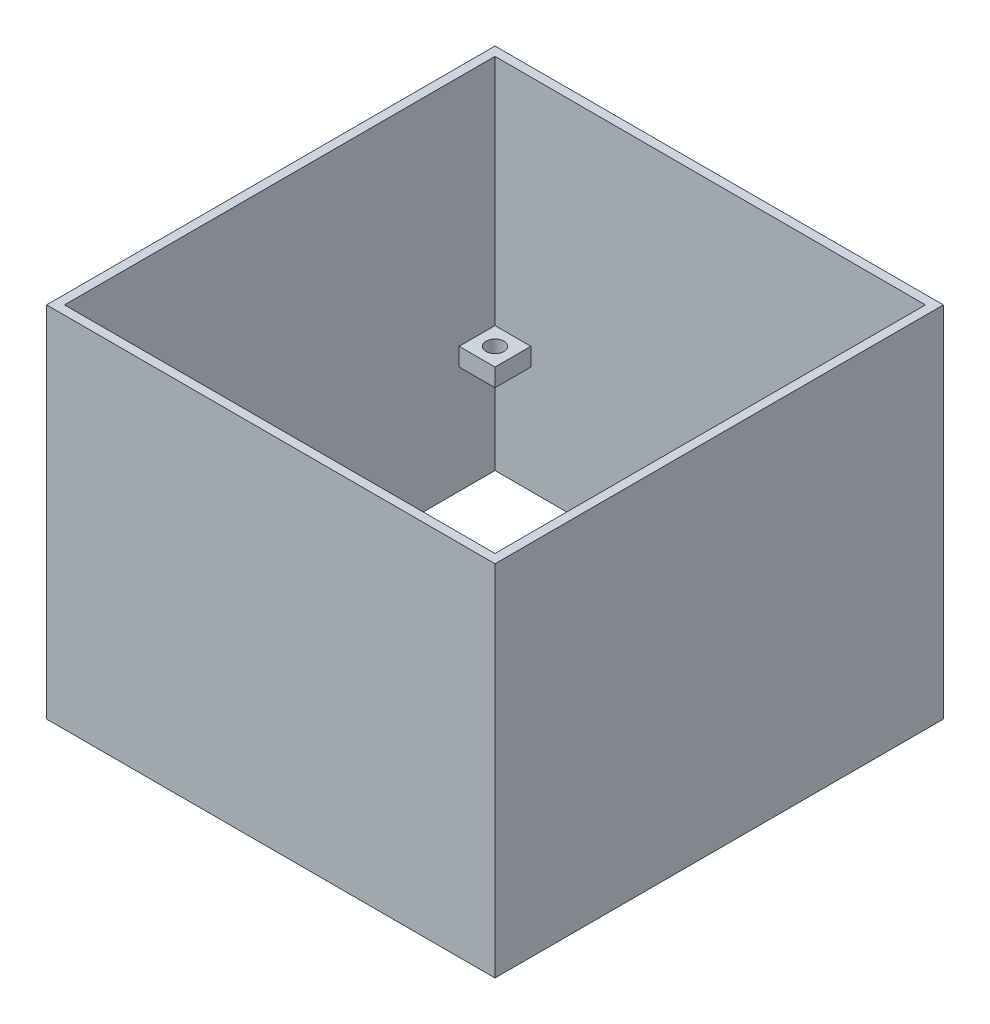
ISO-10303-21;
HEADER;
FILE_DESCRIPTION(('STEP AP214'),'2;1');
FILE_NAME('part.step','',(''),(''),'','','');
FILE_SCHEMA(('AUTOMOTIVE_DESIGN { 1 0 10303 214 1 1 1 1 }'));
ENDSEC;
DATA;
#1=APPLICATION_CONTEXT('core data for automotive mechanical design processes');
#2=APPLICATION_PROTOCOL_DEFINITION('international standard','automotive_design',2000,#1);
#3=PRODUCT_CONTEXT('',#1,'mechanical');
#4=PRODUCT('Part','Part','',(#3));
#5=PRODUCT_RELATED_PRODUCT_CATEGORY('part','',(#4));
#6=PRODUCT_DEFINITION_FORMATION('','',#4);
#7=PRODUCT_DEFINITION_CONTEXT('part definition',#1,'design');
#8=PRODUCT_DEFINITION('design','',#6,#7);
#9=PRODUCT_DEFINITION_SHAPE('','',#8);
#10=(LENGTH_UNIT() NAMED_UNIT(*) SI_UNIT(.MILLI.,.METRE.));
#11=(NAMED_UNIT(*) PLANE_ANGLE_UNIT() SI_UNIT($,.RADIAN.));
#12=(NAMED_UNIT(*) SI_UNIT($,.STERADIAN.) SOLID_ANGLE_UNIT());
#13=UNCERTAINTY_MEASURE_WITH_UNIT(LENGTH_MEASURE(1.E-05),#10,'distance_accuracy_value','');
#14=(GEOMETRIC_REPRESENTATION_CONTEXT(3) GLOBAL_UNCERTAINTY_ASSIGNED_CONTEXT((#13)) GLOBAL_UNIT_ASSIGNED_CONTEXT((#10,
#11,#12)) REPRESENTATION_CONTEXT('',''));
#15=CARTESIAN_POINT('',(0.,0.,0.));
#16=DIRECTION('',(0.,0.,1.));
#17=DIRECTION('',(1.,0.,0.));
#18=AXIS2_PLACEMENT_3D('',#15,#16,#17);
#19=CARTESIAN_POINT('',(0.,100.,0.));
#20=DIRECTION('',(0.,-1.,0.));
#21=DIRECTION('',(0.,0.,-1.));
#22=AXIS2_PLACEMENT_3D('',#19,#20,#21);
#23=PLANE('',#22);
#24=DIRECTION('',(0.,0.,-1.));
#25=VECTOR('',#24,1.);
#26=CARTESIAN_POINT('',(60.,100.,60.));
#27=LINE('',#26,#25);
#28=CARTESIAN_POINT('',(60.0000000000014,100.,60.0000000000014));
#29=VERTEX_POINT('',#28);
#30=CARTESIAN_POINT('',(60.0000000000014,100.,-60.0000000000014));
#31=VERTEX_POINT('',#30);
#32=EDGE_CURVE('E217',#29,#31,#27,.T.);
#33=ORIENTED_EDGE('',*,*,#32,.F.);
#34=DIRECTION('',(1.,0.,0.));
#35=VECTOR('',#34,1.);
#36=CARTESIAN_POINT('',(-60.,100.,60.));
#37=LINE('',#36,#35);
#38=CARTESIAN_POINT('',(-60.0000000000014,100.,60.0000000000014));
#39=VERTEX_POINT('',#38);
#40=EDGE_CURVE('E357',#39,#29,#37,.T.);
#41=ORIENTED_EDGE('',*,*,#40,.F.);
#42=DIRECTION('',(0.,0.,1.));
#43=VECTOR('',#42,1.);
#44=CARTESIAN_POINT('',(-60.,100.,60.));
#45=LINE('',#44,#43);
#46=CARTESIAN_POINT('',(-60.0000000000014,100.,-60.0000000000014));
#47=VERTEX_POINT('',#46);
#48=EDGE_CURVE('E355',#47,#39,#45,.T.);
#49=ORIENTED_EDGE('',*,*,#48,.F.);
#50=DIRECTION('',(-1.,0.,0.));
#51=VECTOR('',#50,1.);
#52=CARTESIAN_POINT('',(-60.,100.,-60.));
#53=LINE('',#52,#51);
#54=EDGE_CURVE('E352',#31,#47,#53,.T.);
#55=ORIENTED_EDGE('',*,*,#54,.F.);
#56=EDGE_LOOP('',(#33,#41,#49,#55));
#57=FACE_BOUND('',#56,.T.);
#58=DIRECTION('',(0.,0.,-1.));
#59=VECTOR('',#58,1.);
#60=CARTESIAN_POINT('',(62.5,100.,62.5));
#61=LINE('',#60,#59);
#62=CARTESIAN_POINT('',(62.5,100.,62.5));
#63=VERTEX_POINT('',#62);
#64=CARTESIAN_POINT('',(62.5,100.,-62.5));
#65=VERTEX_POINT('',#64);
#66=EDGE_CURVE('E378',#63,#65,#61,.T.);
#67=ORIENTED_EDGE('',*,*,#66,.T.);
#68=DIRECTION('',(-1.,0.,0.));
#69=VECTOR('',#68,1.);
#70=CARTESIAN_POINT('',(-62.5,100.,-62.5));
#71=LINE('',#70,#69);
#72=CARTESIAN_POINT('',(-62.5,100.,-62.5));
#73=VERTEX_POINT('',#72);
#74=EDGE_CURVE('E381',#65,#73,#71,.T.);
#75=ORIENTED_EDGE('',*,*,#74,.T.);
#76=DIRECTION('',(0.,0.,1.));
#77=VECTOR('',#76,1.);
#78=CARTESIAN_POINT('',(-62.5,100.,62.5));
#79=LINE('',#78,#77);
#80=CARTESIAN_POINT('',(-62.5,100.,62.5));
#81=VERTEX_POINT('',#80);
#82=EDGE_CURVE('E384',#73,#81,#79,.T.);
#83=ORIENTED_EDGE('',*,*,#82,.T.);
#84=DIRECTION('',(1.,0.,0.));
#85=VECTOR('',#84,1.);
#86=CARTESIAN_POINT('',(-62.5,100.,62.5));
#87=LINE('',#86,#85);
#88=EDGE_CURVE('E386',#81,#63,#87,.T.);
#89=ORIENTED_EDGE('',*,*,#88,.T.);
#90=EDGE_LOOP('',(#67,#75,#83,#89));
#91=FACE_BOUND('',#90,.T.);
#92=ADVANCED_FACE('F41',(#57,#91),#23,.F.);
#93=CARTESIAN_POINT('',(0.,0.,0.));
#94=DIRECTION('',(0.,-1.,0.));
#95=DIRECTION('',(0.,0.,-1.));
#96=AXIS2_PLACEMENT_3D('',#93,#94,#95);
#97=PLANE('',#96);
#98=DIRECTION('',(0.,0.,-1.));
#99=VECTOR('',#98,1.);
#100=CARTESIAN_POINT('',(62.5,0.,62.5));
#101=LINE('',#100,#99);
#102=CARTESIAN_POINT('',(62.5,0.,62.5));
#103=VERTEX_POINT('',#102);
#104=CARTESIAN_POINT('',(62.5,0.,-62.5));
#105=VERTEX_POINT('',#104);
#106=EDGE_CURVE('E377',#103,#105,#101,.T.);
#107=ORIENTED_EDGE('',*,*,#106,.F.);
#108=DIRECTION('',(1.,0.,0.));
#109=VECTOR('',#108,1.);
#110=CARTESIAN_POINT('',(-62.5,0.,62.5));
#111=LINE('',#110,#109);
#112=CARTESIAN_POINT('',(-62.5,0.,62.5));
#113=VERTEX_POINT('',#112);
#114=EDGE_CURVE('E382',#113,#103,#111,.T.);
#115=ORIENTED_EDGE('',*,*,#114,.F.);
#116=DIRECTION('',(0.,0.,1.));
#117=VECTOR('',#116,1.);
#118=CARTESIAN_POINT('',(-62.5,0.,62.5));
#119=LINE('',#118,#117);
#120=CARTESIAN_POINT('',(-62.5,0.,-62.5));
#121=VERTEX_POINT('',#120);
#122=EDGE_CURVE('E393',#121,#113,#119,.T.);
#123=ORIENTED_EDGE('',*,*,#122,.F.);
#124=DIRECTION('',(-1.,0.,0.));
#125=VECTOR('',#124,1.);
#126=CARTESIAN_POINT('',(-62.5,0.,-62.5));
#127=LINE('',#126,#125);
#128=EDGE_CURVE('E391',#105,#121,#127,.T.);
#129=ORIENTED_EDGE('',*,*,#128,.F.);
#130=EDGE_LOOP('',(#107,#115,#123,#129));
#131=FACE_BOUND('',#130,.T.);
#132=DIRECTION('',(1.,0.,0.));
#133=VECTOR('',#132,1.);
#134=CARTESIAN_POINT('',(-60.,0.,60.));
#135=LINE('',#134,#133);
#136=CARTESIAN_POINT('',(-60.,0.,60.));
#137=VERTEX_POINT('',#136);
#138=CARTESIAN_POINT('',(60.,0.,60.));
#139=VERTEX_POINT('',#138);
#140=EDGE_CURVE('E353',#137,#139,#135,.T.);
#141=ORIENTED_EDGE('',*,*,#140,.T.);
#142=DIRECTION('',(0.,0.,-1.));
#143=VECTOR('',#142,1.);
#144=CARTESIAN_POINT('',(60.,0.,60.));
#145=LINE('',#144,#143);
#146=CARTESIAN_POINT('',(60.,0.,-60.));
#147=VERTEX_POINT('',#146);
#148=EDGE_CURVE('E345',#139,#147,#145,.T.);
#149=ORIENTED_EDGE('',*,*,#148,.T.);
#150=DIRECTION('',(-1.,0.,0.));
#151=VECTOR('',#150,1.);
#152=CARTESIAN_POINT('',(-60.,0.,-60.));
#153=LINE('',#152,#151);
#154=CARTESIAN_POINT('',(-60.,0.,-60.));
#155=VERTEX_POINT('',#154);
#156=EDGE_CURVE('E362',#147,#155,#153,.T.);
#157=ORIENTED_EDGE('',*,*,#156,.T.);
#158=DIRECTION('',(0.,0.,1.));
#159=VECTOR('',#158,1.);
#160=CARTESIAN_POINT('',(-60.,0.,60.));
#161=LINE('',#160,#159);
#162=EDGE_CURVE('E365',#155,#137,#161,.T.);
#163=ORIENTED_EDGE('',*,*,#162,.T.);
#164=EDGE_LOOP('',(#141,#149,#157,#163));
#165=FACE_BOUND('',#164,.T.);
#166=ADVANCED_FACE('F414',(#131,#165),#97,.T.);
#167=CARTESIAN_POINT('',(62.5,100.,62.5));
#168=DIRECTION('',(-1.,0.,0.));
#169=DIRECTION('',(0.,0.,1.));
#170=AXIS2_PLACEMENT_3D('',#167,#168,#169);
#171=PLANE('',#170);
#172=ORIENTED_EDGE('',*,*,#106,.T.);
#173=DIRECTION('',(0.,-1.,0.));
#174=VECTOR('',#173,1.);
#175=CARTESIAN_POINT('',(62.5,100.,-62.5));
#176=LINE('',#175,#174);
#177=EDGE_CURVE('E49',#65,#105,#176,.T.);
#178=ORIENTED_EDGE('',*,*,#177,.F.);
#179=ORIENTED_EDGE('',*,*,#66,.F.);
#180=DIRECTION('',(0.,-1.,0.));
#181=VECTOR('',#180,1.);
#182=CARTESIAN_POINT('',(62.5,100.,62.5));
#183=LINE('',#182,#181);
#184=EDGE_CURVE('E388',#63,#103,#183,.T.);
#185=ORIENTED_EDGE('',*,*,#184,.T.);
#186=EDGE_LOOP('',(#172,#178,#179,#185));
#187=FACE_BOUND('',#186,.T.);
#188=ADVANCED_FACE('F43',(#187),#171,.F.);
#189=CARTESIAN_POINT('',(-62.5,100.,-62.5));
#190=DIRECTION('',(0.,0.,1.));
#191=DIRECTION('',(1.,0.,0.));
#192=AXIS2_PLACEMENT_3D('',#189,#190,#191);
#193=PLANE('',#192);
#194=ORIENTED_EDGE('',*,*,#128,.T.);
#195=DIRECTION('',(0.,-1.,0.));
#196=VECTOR('',#195,1.);
#197=CARTESIAN_POINT('',(-62.5,100.,-62.5));
#198=LINE('',#197,#196);
#199=EDGE_CURVE('E401',#73,#121,#198,.T.);
#200=ORIENTED_EDGE('',*,*,#199,.F.);
#201=ORIENTED_EDGE('',*,*,#74,.F.);
#202=ORIENTED_EDGE('',*,*,#177,.T.);
#203=EDGE_LOOP('',(#194,#200,#201,#202));
#204=FACE_BOUND('',#203,.T.);
#205=ADVANCED_FACE('F406',(#204),#193,.F.);
#206=CARTESIAN_POINT('',(-62.5,100.,62.5));
#207=DIRECTION('',(1.,0.,0.));
#208=DIRECTION('',(0.,0.,-1.));
#209=AXIS2_PLACEMENT_3D('',#206,#207,#208);
#210=PLANE('',#209);
#211=ORIENTED_EDGE('',*,*,#122,.T.);
#212=DIRECTION('',(0.,-1.,0.));
#213=VECTOR('',#212,1.);
#214=CARTESIAN_POINT('',(-62.5,100.,62.5));
#215=LINE('',#214,#213);
#216=EDGE_CURVE('E398',#81,#113,#215,.T.);
#217=ORIENTED_EDGE('',*,*,#216,.F.);
#218=ORIENTED_EDGE('',*,*,#82,.F.);
#219=ORIENTED_EDGE('',*,*,#199,.T.);
#220=EDGE_LOOP('',(#211,#217,#218,#219));
#221=FACE_BOUND('',#220,.T.);
#222=ADVANCED_FACE('F419',(#221),#210,.F.);
#223=CARTESIAN_POINT('',(-62.5,100.,62.5));
#224=DIRECTION('',(0.,0.,-1.));
#225=DIRECTION('',(-1.,0.,0.));
#226=AXIS2_PLACEMENT_3D('',#223,#224,#225);
#227=PLANE('',#226);
#228=ORIENTED_EDGE('',*,*,#114,.T.);
#229=ORIENTED_EDGE('',*,*,#184,.F.);
#230=ORIENTED_EDGE('',*,*,#88,.F.);
#231=ORIENTED_EDGE('',*,*,#216,.T.);
#232=EDGE_LOOP('',(#228,#229,#230,#231));
#233=FACE_BOUND('',#232,.T.);
#234=ADVANCED_FACE('F423',(#233),#227,.F.);
#235=CARTESIAN_POINT('',(60.,100.,60.));
#236=DIRECTION('',(-1.,0.,0.));
#237=DIRECTION('',(0.,0.,1.));
#238=AXIS2_PLACEMENT_3D('',#235,#236,#237);
#239=PLANE('',#238);
#240=DIRECTION('',(0.,1.,0.));
#241=VECTOR('',#240,1.);
#242=CARTESIAN_POINT('',(60.0000000000014,30.,49.9999999999986));
#243=LINE('',#242,#241);
#244=CARTESIAN_POINT('',(60.,30.,49.9999999999986));
#245=VERTEX_POINT('',#244);
#246=CARTESIAN_POINT('',(60.0000000000014,35.0000000000001,49.9999999999986));
#247=VERTEX_POINT('',#246);
#248=EDGE_CURVE('E297',#245,#247,#243,.T.);
#249=ORIENTED_EDGE('',*,*,#248,.T.);
#250=DIRECTION('',(0.,0.,-1.));
#251=VECTOR('',#250,1.);
#252=CARTESIAN_POINT('',(60.0000000000014,35.0000000000001,60.0000000000014));
#253=LINE('',#252,#251);
#254=CARTESIAN_POINT('',(60.0000000000014,35.0000000000001,60.0000000000014));
#255=VERTEX_POINT('',#254);
#256=EDGE_CURVE('E56',#255,#247,#253,.T.);
#257=ORIENTED_EDGE('',*,*,#256,.F.);
#258=DIRECTION('',(0.,1.,0.));
#259=VECTOR('',#258,1.);
#260=CARTESIAN_POINT('',(60.0000000000014,35.0000000000001,60.0000000000014));
#261=LINE('',#260,#259);
#262=EDGE_CURVE('E234',#255,#29,#261,.T.);
#263=ORIENTED_EDGE('',*,*,#262,.T.);
#264=ORIENTED_EDGE('',*,*,#32,.T.);
#265=DIRECTION('',(0.,1.,0.));
#266=VECTOR('',#265,1.);
#267=CARTESIAN_POINT('',(60.0000000000014,35.0000000000001,-60.0000000000014));
#268=LINE('',#267,#266);
#269=CARTESIAN_POINT('',(60.0000000000014,35.0000000000001,-60.0000000000014));
#270=VERTEX_POINT('',#269);
#271=EDGE_CURVE('E212',#270,#31,#268,.T.);
#272=ORIENTED_EDGE('',*,*,#271,.F.);
#273=CARTESIAN_POINT('',(60.0000000000014,35.0000000000001,-50.0000000000014));
#274=VERTEX_POINT('',#273);
#275=EDGE_CURVE('E200',#274,#270,#253,.T.);
#276=ORIENTED_EDGE('',*,*,#275,.F.);
#277=DIRECTION('',(0.,1.,0.));
#278=VECTOR('',#277,1.);
#279=CARTESIAN_POINT('',(60.,30.,-50.0000000000014));
#280=LINE('',#279,#278);
#281=CARTESIAN_POINT('',(60.,30.,-50.0000000000014));
#282=VERTEX_POINT('',#281);
#283=EDGE_CURVE('E284',#282,#274,#280,.T.);
#284=ORIENTED_EDGE('',*,*,#283,.F.);
#285=DIRECTION('',(0.,0.,-1.));
#286=VECTOR('',#285,1.);
#287=CARTESIAN_POINT('',(60.,30.,-60.0000000000014));
#288=LINE('',#287,#286);
#289=CARTESIAN_POINT('',(60.,30.,-60.));
#290=VERTEX_POINT('',#289);
#291=EDGE_CURVE('E294',#282,#290,#288,.T.);
#292=ORIENTED_EDGE('',*,*,#291,.T.);
#293=DIRECTION('',(0.,-1.,0.));
#294=VECTOR('',#293,1.);
#295=CARTESIAN_POINT('',(60.,100.,-60.));
#296=LINE('',#295,#294);
#297=EDGE_CURVE('E375',#290,#147,#296,.T.);
#298=ORIENTED_EDGE('',*,*,#297,.T.);
#299=ORIENTED_EDGE('',*,*,#148,.F.);
#300=DIRECTION('',(0.,-1.,0.));
#301=VECTOR('',#300,1.);
#302=CARTESIAN_POINT('',(60.,100.,60.));
#303=LINE('',#302,#301);
#304=CARTESIAN_POINT('',(60.,30.,60.));
#305=VERTEX_POINT('',#304);
#306=EDGE_CURVE('E359',#305,#139,#303,.T.);
#307=ORIENTED_EDGE('',*,*,#306,.F.);
#308=DIRECTION('',(0.,0.,-1.));
#309=VECTOR('',#308,1.);
#310=CARTESIAN_POINT('',(60.0000000000014,30.,59.9999999999986));
#311=LINE('',#310,#309);
#312=EDGE_CURVE('E312',#305,#245,#311,.T.);
#313=ORIENTED_EDGE('',*,*,#312,.T.);
#314=EDGE_LOOP('',(#249,#257,#263,#264,#272,#276,#284,#292,#298,#299,#307,#313));
#315=FACE_BOUND('',#314,.T.);
#316=ADVANCED_FACE('F214',(#315),#239,.T.);
#317=CARTESIAN_POINT('',(-60.,100.,-60.));
#318=DIRECTION('',(0.,0.,1.));
#319=DIRECTION('',(1.,0.,0.));
#320=AXIS2_PLACEMENT_3D('',#317,#318,#319);
#321=PLANE('',#320);
#322=DIRECTION('',(0.,1.,0.));
#323=VECTOR('',#322,1.);
#324=CARTESIAN_POINT('',(50.,30.,-60.0000000000014));
#325=LINE('',#324,#323);
#326=CARTESIAN_POINT('',(50.,30.,-60.));
#327=VERTEX_POINT('',#326);
#328=CARTESIAN_POINT('',(50.,35.0000000000001,-60.0000000000014));
#329=VERTEX_POINT('',#328);
#330=EDGE_CURVE('E225',#327,#329,#325,.T.);
#331=ORIENTED_EDGE('',*,*,#330,.T.);
#332=DIRECTION('',(-1.,0.,0.));
#333=VECTOR('',#332,1.);
#334=CARTESIAN_POINT('',(-60.0000000000014,35.0000000000001,-60.0000000000014));
#335=LINE('',#334,#333);
#336=EDGE_CURVE('E204',#270,#329,#335,.T.);
#337=ORIENTED_EDGE('',*,*,#336,.F.);
#338=ORIENTED_EDGE('',*,*,#271,.T.);
#339=ORIENTED_EDGE('',*,*,#54,.T.);
#340=DIRECTION('',(0.,1.,0.));
#341=VECTOR('',#340,1.);
#342=CARTESIAN_POINT('',(-60.0000000000014,35.0000000000001,-60.0000000000014));
#343=LINE('',#342,#341);
#344=CARTESIAN_POINT('',(-60.0000000000014,35.0000000000001,-60.0000000000014));
#345=VERTEX_POINT('',#344);
#346=EDGE_CURVE('E220',#345,#47,#343,.T.);
#347=ORIENTED_EDGE('',*,*,#346,.F.);
#348=CARTESIAN_POINT('',(-50.,35.0000000000001,-60.0000000000014));
#349=VERTEX_POINT('',#348);
#350=EDGE_CURVE('E227',#349,#345,#335,.T.);
#351=ORIENTED_EDGE('',*,*,#350,.F.);
#352=DIRECTION('',(0.,1.,0.));
#353=VECTOR('',#352,1.);
#354=CARTESIAN_POINT('',(-50.,30.,-60.));
#355=LINE('',#354,#353);
#356=CARTESIAN_POINT('',(-50.,30.,-60.));
#357=VERTEX_POINT('',#356);
#358=EDGE_CURVE('E342',#357,#349,#355,.T.);
#359=ORIENTED_EDGE('',*,*,#358,.F.);
#360=DIRECTION('',(-1.,0.,0.));
#361=VECTOR('',#360,1.);
#362=CARTESIAN_POINT('',(-60.,30.,-60.));
#363=LINE('',#362,#361);
#364=CARTESIAN_POINT('',(-60.,30.,-60.));
#365=VERTEX_POINT('',#364);
#366=EDGE_CURVE('E339',#357,#365,#363,.T.);
#367=ORIENTED_EDGE('',*,*,#366,.T.);
#368=DIRECTION('',(0.,-1.,0.));
#369=VECTOR('',#368,1.);
#370=CARTESIAN_POINT('',(-60.,100.,-60.));
#371=LINE('',#370,#369);
#372=EDGE_CURVE('E373',#365,#155,#371,.T.);
#373=ORIENTED_EDGE('',*,*,#372,.T.);
#374=ORIENTED_EDGE('',*,*,#156,.F.);
#375=ORIENTED_EDGE('',*,*,#297,.F.);
#376=DIRECTION('',(-1.,0.,0.));
#377=VECTOR('',#376,1.);
#378=CARTESIAN_POINT('',(60.,30.,-60.0000000000014));
#379=LINE('',#378,#377);
#380=EDGE_CURVE('E292',#290,#327,#379,.T.);
#381=ORIENTED_EDGE('',*,*,#380,.T.);
#382=EDGE_LOOP('',(#331,#337,#338,#339,#347,#351,#359,#367,#373,#374,#375,#381));
#383=FACE_BOUND('',#382,.T.);
#384=ADVANCED_FACE('F223',(#383),#321,.T.);
#385=CARTESIAN_POINT('',(-60.,100.,60.));
#386=DIRECTION('',(1.,0.,0.));
#387=DIRECTION('',(0.,0.,-1.));
#388=AXIS2_PLACEMENT_3D('',#385,#386,#387);
#389=PLANE('',#388);
#390=DIRECTION('',(0.,1.,0.));
#391=VECTOR('',#390,1.);
#392=CARTESIAN_POINT('',(-60.,30.,-50.));
#393=LINE('',#392,#391);
#394=CARTESIAN_POINT('',(-60.,30.,-50.));
#395=VERTEX_POINT('',#394);
#396=CARTESIAN_POINT('',(-60.,35.0000000000001,-50.));
#397=VERTEX_POINT('',#396);
#398=EDGE_CURVE('E341',#395,#397,#393,.T.);
#399=ORIENTED_EDGE('',*,*,#398,.T.);
#400=DIRECTION('',(0.,0.,1.));
#401=VECTOR('',#400,1.);
#402=CARTESIAN_POINT('',(-60.0000000000014,35.0000000000001,60.0000000000014));
#403=LINE('',#402,#401);
#404=EDGE_CURVE('E229',#345,#397,#403,.T.);
#405=ORIENTED_EDGE('',*,*,#404,.F.);
#406=ORIENTED_EDGE('',*,*,#346,.T.);
#407=ORIENTED_EDGE('',*,*,#48,.T.);
#408=DIRECTION('',(0.,1.,0.));
#409=VECTOR('',#408,1.);
#410=CARTESIAN_POINT('',(-60.0000000000014,35.0000000000001,60.0000000000014));
#411=LINE('',#410,#409);
#412=CARTESIAN_POINT('',(-60.0000000000014,35.0000000000001,60.0000000000014));
#413=VERTEX_POINT('',#412);
#414=EDGE_CURVE('E236',#413,#39,#411,.T.);
#415=ORIENTED_EDGE('',*,*,#414,.F.);
#416=CARTESIAN_POINT('',(-60.0000000000014,35.0000000000001,50.));
#417=VERTEX_POINT('',#416);
#418=EDGE_CURVE('E226',#417,#413,#403,.T.);
#419=ORIENTED_EDGE('',*,*,#418,.F.);
#420=DIRECTION('',(0.,1.,0.));
#421=VECTOR('',#420,1.);
#422=CARTESIAN_POINT('',(-59.9999999999986,30.,50.));
#423=LINE('',#422,#421);
#424=CARTESIAN_POINT('',(-60.,30.,50.));
#425=VERTEX_POINT('',#424);
#426=EDGE_CURVE('E278',#425,#417,#423,.T.);
#427=ORIENTED_EDGE('',*,*,#426,.F.);
#428=DIRECTION('',(0.,0.,1.));
#429=VECTOR('',#428,1.);
#430=CARTESIAN_POINT('',(-59.9999999999986,30.,60.));
#431=LINE('',#430,#429);
#432=CARTESIAN_POINT('',(-60.,30.,60.));
#433=VERTEX_POINT('',#432);
#434=EDGE_CURVE('E306',#425,#433,#431,.T.);
#435=ORIENTED_EDGE('',*,*,#434,.T.);
#436=DIRECTION('',(0.,-1.,0.));
#437=VECTOR('',#436,1.);
#438=CARTESIAN_POINT('',(-60.,100.,60.));
#439=LINE('',#438,#437);
#440=EDGE_CURVE('E371',#433,#137,#439,.T.);
#441=ORIENTED_EDGE('',*,*,#440,.T.);
#442=ORIENTED_EDGE('',*,*,#162,.F.);
#443=ORIENTED_EDGE('',*,*,#372,.F.);
#444=DIRECTION('',(0.,0.,1.));
#445=VECTOR('',#444,1.);
#446=CARTESIAN_POINT('',(-60.,30.,-60.));
#447=LINE('',#446,#445);
#448=EDGE_CURVE('E296',#365,#395,#447,.T.);
#449=ORIENTED_EDGE('',*,*,#448,.T.);
#450=EDGE_LOOP('',(#399,#405,#406,#407,#415,#419,#427,#435,#441,#442,#443,#449));
#451=FACE_BOUND('',#450,.T.);
#452=ADVANCED_FACE('F476',(#451),#389,.T.);
#453=CARTESIAN_POINT('',(-60.,100.,60.));
#454=DIRECTION('',(0.,0.,-1.));
#455=DIRECTION('',(-1.,0.,0.));
#456=AXIS2_PLACEMENT_3D('',#453,#454,#455);
#457=PLANE('',#456);
#458=DIRECTION('',(0.,1.,0.));
#459=VECTOR('',#458,1.);
#460=CARTESIAN_POINT('',(-49.9999999999986,30.,60.));
#461=LINE('',#460,#459);
#462=CARTESIAN_POINT('',(-49.9999999999986,30.,60.));
#463=VERTEX_POINT('',#462);
#464=CARTESIAN_POINT('',(-49.9999999999986,35.0000000000001,60.));
#465=VERTEX_POINT('',#464);
#466=EDGE_CURVE('E315',#463,#465,#461,.T.);
#467=ORIENTED_EDGE('',*,*,#466,.T.);
#468=DIRECTION('',(1.,0.,0.));
#469=VECTOR('',#468,1.);
#470=CARTESIAN_POINT('',(-60.0000000000014,35.0000000000001,60.0000000000014));
#471=LINE('',#470,#469);
#472=EDGE_CURVE('E64',#413,#465,#471,.T.);
#473=ORIENTED_EDGE('',*,*,#472,.F.);
#474=ORIENTED_EDGE('',*,*,#414,.T.);
#475=ORIENTED_EDGE('',*,*,#40,.T.);
#476=ORIENTED_EDGE('',*,*,#262,.F.);
#477=CARTESIAN_POINT('',(50.0000000000014,35.0000000000001,60.0000000000014));
#478=VERTEX_POINT('',#477);
#479=EDGE_CURVE('E232',#478,#255,#471,.T.);
#480=ORIENTED_EDGE('',*,*,#479,.F.);
#481=DIRECTION('',(0.,1.,0.));
#482=VECTOR('',#481,1.);
#483=CARTESIAN_POINT('',(50.0000000000014,30.,59.9999999999986));
#484=LINE('',#483,#482);
#485=CARTESIAN_POINT('',(50.0000000000014,30.,60.));
#486=VERTEX_POINT('',#485);
#487=EDGE_CURVE('E303',#486,#478,#484,.T.);
#488=ORIENTED_EDGE('',*,*,#487,.F.);
#489=DIRECTION('',(1.,0.,0.));
#490=VECTOR('',#489,1.);
#491=CARTESIAN_POINT('',(60.0000000000014,30.,59.9999999999986));
#492=LINE('',#491,#490);
#493=EDGE_CURVE('E286',#486,#305,#492,.T.);
#494=ORIENTED_EDGE('',*,*,#493,.T.);
#495=ORIENTED_EDGE('',*,*,#306,.T.);
#496=ORIENTED_EDGE('',*,*,#140,.F.);
#497=ORIENTED_EDGE('',*,*,#440,.F.);
#498=DIRECTION('',(1.,0.,0.));
#499=VECTOR('',#498,1.);
#500=CARTESIAN_POINT('',(-59.9999999999986,30.,60.));
#501=LINE('',#500,#499);
#502=EDGE_CURVE('E329',#433,#463,#501,.T.);
#503=ORIENTED_EDGE('',*,*,#502,.T.);
#504=EDGE_LOOP('',(#467,#473,#474,#475,#476,#480,#488,#494,#495,#496,#497,#503));
#505=FACE_BOUND('',#504,.T.);
#506=ADVANCED_FACE('F468',(#505),#457,.T.);
#507=CARTESIAN_POINT('',(50.0000000000014,30.,59.9999999999986));
#508=DIRECTION('',(-1.,0.,0.));
#509=DIRECTION('',(0.,0.,1.));
#510=AXIS2_PLACEMENT_3D('',#507,#508,#509);
#511=PLANE('',#510);
#512=DIRECTION('',(0.,0.,1.));
#513=VECTOR('',#512,1.);
#514=CARTESIAN_POINT('',(50.0000000000014,35.0000000000001,59.9999999999986));
#515=LINE('',#514,#513);
#516=CARTESIAN_POINT('',(50.0000000000014,35.0000000000001,49.9999999999986));
#517=VERTEX_POINT('',#516);
#518=EDGE_CURVE('E252',#517,#478,#515,.T.);
#519=ORIENTED_EDGE('',*,*,#518,.F.);
#520=DIRECTION('',(0.,1.,0.));
#521=VECTOR('',#520,1.);
#522=CARTESIAN_POINT('',(50.0000000000014,30.,49.9999999999986));
#523=LINE('',#522,#521);
#524=CARTESIAN_POINT('',(50.0000000000014,30.,49.9999999999986));
#525=VERTEX_POINT('',#524);
#526=EDGE_CURVE('E300',#525,#517,#523,.T.);
#527=ORIENTED_EDGE('',*,*,#526,.F.);
#528=DIRECTION('',(0.,0.,1.));
#529=VECTOR('',#528,1.);
#530=CARTESIAN_POINT('',(50.0000000000014,30.,59.9999999999986));
#531=LINE('',#530,#529);
#532=EDGE_CURVE('E299',#525,#486,#531,.T.);
#533=ORIENTED_EDGE('',*,*,#532,.T.);
#534=ORIENTED_EDGE('',*,*,#487,.T.);
#535=EDGE_LOOP('',(#519,#527,#533,#534));
#536=FACE_BOUND('',#535,.T.);
#537=ADVANCED_FACE('F475',(#536),#511,.T.);
#538=CARTESIAN_POINT('',(60.0000000000014,30.,49.9999999999986));
#539=DIRECTION('',(0.,0.,-1.));
#540=DIRECTION('',(-1.,0.,0.));
#541=AXIS2_PLACEMENT_3D('',#538,#539,#540);
#542=PLANE('',#541);
#543=DIRECTION('',(-1.,0.,0.));
#544=VECTOR('',#543,1.);
#545=CARTESIAN_POINT('',(60.0000000000014,35.0000000000001,49.9999999999986));
#546=LINE('',#545,#544);
#547=EDGE_CURVE('E250',#247,#517,#546,.T.);
#548=ORIENTED_EDGE('',*,*,#547,.F.);
#549=ORIENTED_EDGE('',*,*,#248,.F.);
#550=DIRECTION('',(-1.,0.,0.));
#551=VECTOR('',#550,1.);
#552=CARTESIAN_POINT('',(60.0000000000014,30.,49.9999999999986));
#553=LINE('',#552,#551);
#554=EDGE_CURVE('E309',#245,#525,#553,.T.);
#555=ORIENTED_EDGE('',*,*,#554,.T.);
#556=ORIENTED_EDGE('',*,*,#526,.T.);
#557=EDGE_LOOP('',(#548,#549,#555,#556));
#558=FACE_BOUND('',#557,.T.);
#559=ADVANCED_FACE('F535',(#558),#542,.T.);
#560=CARTESIAN_POINT('',(0.,30.,0.));
#561=DIRECTION('',(0.,-1.,0.));
#562=DIRECTION('',(0.,0.,-1.));
#563=AXIS2_PLACEMENT_3D('',#560,#561,#562);
#564=PLANE('',#563);
#565=CARTESIAN_POINT('',(55.0000000000037,30.,55.0000000000018));
#566=DIRECTION('',(0.,-1.,0.));
#567=DIRECTION('',(0.,0.,-1.));
#568=AXIS2_PLACEMENT_3D('',#565,#566,#567);
#569=CIRCLE('',#568,2.5000000000016);
#570=CARTESIAN_POINT('',(55.0000000000037,30.,52.5000000000002));
#571=VERTEX_POINT('',#570);
#572=EDGE_CURVE('E255',#571,#571,#569,.T.);
#573=ORIENTED_EDGE('',*,*,#572,.F.);
#574=EDGE_LOOP('',(#573));
#575=FACE_BOUND('',#574,.T.);
#576=ORIENTED_EDGE('',*,*,#493,.F.);
#577=ORIENTED_EDGE('',*,*,#532,.F.);
#578=ORIENTED_EDGE('',*,*,#554,.F.);
#579=ORIENTED_EDGE('',*,*,#312,.F.);
#580=EDGE_LOOP('',(#576,#577,#578,#579));
#581=FACE_BOUND('',#580,.T.);
#582=ADVANCED_FACE('F530',(#575,#581),#564,.T.);
#583=CARTESIAN_POINT('',(-59.9999999999986,30.,50.));
#584=DIRECTION('',(0.,0.,-1.));
#585=DIRECTION('',(-1.,0.,0.));
#586=AXIS2_PLACEMENT_3D('',#583,#584,#585);
#587=PLANE('',#586);
#588=DIRECTION('',(-1.,0.,0.));
#589=VECTOR('',#588,1.);
#590=CARTESIAN_POINT('',(-59.9999999999986,35.0000000000001,50.));
#591=LINE('',#590,#589);
#592=CARTESIAN_POINT('',(-49.9999999999986,35.0000000000001,50.));
#593=VERTEX_POINT('',#592);
#594=EDGE_CURVE('E248',#593,#417,#591,.T.);
#595=ORIENTED_EDGE('',*,*,#594,.F.);
#596=DIRECTION('',(0.,1.,0.));
#597=VECTOR('',#596,1.);
#598=CARTESIAN_POINT('',(-49.9999999999986,30.,50.));
#599=LINE('',#598,#597);
#600=CARTESIAN_POINT('',(-49.9999999999986,30.,50.));
#601=VERTEX_POINT('',#600);
#602=EDGE_CURVE('E319',#601,#593,#599,.T.);
#603=ORIENTED_EDGE('',*,*,#602,.F.);
#604=DIRECTION('',(-1.,0.,0.));
#605=VECTOR('',#604,1.);
#606=CARTESIAN_POINT('',(-59.9999999999986,30.,50.));
#607=LINE('',#606,#605);
#608=EDGE_CURVE('E318',#601,#425,#607,.T.);
#609=ORIENTED_EDGE('',*,*,#608,.T.);
#610=ORIENTED_EDGE('',*,*,#426,.T.);
#611=EDGE_LOOP('',(#595,#603,#609,#610));
#612=FACE_BOUND('',#611,.T.);
#613=ADVANCED_FACE('F534',(#612),#587,.T.);
#614=CARTESIAN_POINT('',(-49.9999999999986,30.,60.));
#615=DIRECTION('',(1.,0.,0.));
#616=DIRECTION('',(0.,0.,-1.));
#617=AXIS2_PLACEMENT_3D('',#614,#615,#616);
#618=PLANE('',#617);
#619=DIRECTION('',(0.,0.,-1.));
#620=VECTOR('',#619,1.);
#621=CARTESIAN_POINT('',(-49.9999999999986,35.0000000000001,60.));
#622=LINE('',#621,#620);
#623=EDGE_CURVE('E246',#465,#593,#622,.T.);
#624=ORIENTED_EDGE('',*,*,#623,.F.);
#625=ORIENTED_EDGE('',*,*,#466,.F.);
#626=DIRECTION('',(0.,0.,-1.));
#627=VECTOR('',#626,1.);
#628=CARTESIAN_POINT('',(-49.9999999999986,30.,60.));
#629=LINE('',#628,#627);
#630=EDGE_CURVE('E326',#463,#601,#629,.T.);
#631=ORIENTED_EDGE('',*,*,#630,.T.);
#632=ORIENTED_EDGE('',*,*,#602,.T.);
#633=EDGE_LOOP('',(#624,#625,#631,#632));
#634=FACE_BOUND('',#633,.T.);
#635=ADVANCED_FACE('F548',(#634),#618,.T.);
#636=CARTESIAN_POINT('',(0.,30.,0.));
#637=DIRECTION('',(0.,-1.,0.));
#638=DIRECTION('',(0.,0.,-1.));
#639=AXIS2_PLACEMENT_3D('',#636,#637,#638);
#640=PLANE('',#639);
#641=CARTESIAN_POINT('',(-54.9999999999987,30.,55.0000000000037));
#642=DIRECTION('',(0.,-1.,0.));
#643=DIRECTION('',(0.,0.,-1.));
#644=AXIS2_PLACEMENT_3D('',#641,#642,#643);
#645=CIRCLE('',#644,2.49999999999837);
#646=CARTESIAN_POINT('',(-54.9999999999987,30.,52.5000000000053));
#647=VERTEX_POINT('',#646);
#648=EDGE_CURVE('E258',#647,#647,#645,.T.);
#649=ORIENTED_EDGE('',*,*,#648,.F.);
#650=EDGE_LOOP('',(#649));
#651=FACE_BOUND('',#650,.T.);
#652=ORIENTED_EDGE('',*,*,#434,.F.);
#653=ORIENTED_EDGE('',*,*,#608,.F.);
#654=ORIENTED_EDGE('',*,*,#630,.F.);
#655=ORIENTED_EDGE('',*,*,#502,.F.);
#656=EDGE_LOOP('',(#652,#653,#654,#655));
#657=FACE_BOUND('',#656,.T.);
#658=ADVANCED_FACE('F543',(#651,#657),#640,.T.);
#659=CARTESIAN_POINT('',(-50.,30.,-60.));
#660=DIRECTION('',(1.,0.,0.));
#661=DIRECTION('',(0.,0.,-1.));
#662=AXIS2_PLACEMENT_3D('',#659,#660,#661);
#663=PLANE('',#662);
#664=DIRECTION('',(0.,0.,-1.));
#665=VECTOR('',#664,1.);
#666=CARTESIAN_POINT('',(-50.,35.0000000000001,-60.));
#667=LINE('',#666,#665);
#668=CARTESIAN_POINT('',(-50.,35.0000000000001,-50.));
#669=VERTEX_POINT('',#668);
#670=EDGE_CURVE('E244',#669,#349,#667,.T.);
#671=ORIENTED_EDGE('',*,*,#670,.F.);
#672=DIRECTION('',(0.,1.,0.));
#673=VECTOR('',#672,1.);
#674=CARTESIAN_POINT('',(-50.,30.,-50.));
#675=LINE('',#674,#673);
#676=CARTESIAN_POINT('',(-50.,30.,-50.));
#677=VERTEX_POINT('',#676);
#678=EDGE_CURVE('E346',#677,#669,#675,.T.);
#679=ORIENTED_EDGE('',*,*,#678,.F.);
#680=DIRECTION('',(0.,0.,-1.));
#681=VECTOR('',#680,1.);
#682=CARTESIAN_POINT('',(-50.,30.,-60.));
#683=LINE('',#682,#681);
#684=EDGE_CURVE('E336',#677,#357,#683,.T.);
#685=ORIENTED_EDGE('',*,*,#684,.T.);
#686=ORIENTED_EDGE('',*,*,#358,.T.);
#687=EDGE_LOOP('',(#671,#679,#685,#686));
#688=FACE_BOUND('',#687,.T.);
#689=ADVANCED_FACE('F547',(#688),#663,.T.);
#690=CARTESIAN_POINT('',(-60.,30.,-50.));
#691=DIRECTION('',(0.,0.,1.));
#692=DIRECTION('',(1.,0.,0.));
#693=AXIS2_PLACEMENT_3D('',#690,#691,#692);
#694=PLANE('',#693);
#695=DIRECTION('',(1.,0.,0.));
#696=VECTOR('',#695,1.);
#697=CARTESIAN_POINT('',(-60.,35.0000000000001,-50.));
#698=LINE('',#697,#696);
#699=EDGE_CURVE('E242',#397,#669,#698,.T.);
#700=ORIENTED_EDGE('',*,*,#699,.F.);
#701=ORIENTED_EDGE('',*,*,#398,.F.);
#702=DIRECTION('',(1.,0.,0.));
#703=VECTOR('',#702,1.);
#704=CARTESIAN_POINT('',(-60.,30.,-50.));
#705=LINE('',#704,#703);
#706=EDGE_CURVE('E333',#395,#677,#705,.T.);
#707=ORIENTED_EDGE('',*,*,#706,.T.);
#708=ORIENTED_EDGE('',*,*,#678,.T.);
#709=EDGE_LOOP('',(#700,#701,#707,#708));
#710=FACE_BOUND('',#709,.T.);
#711=ADVANCED_FACE('F561',(#710),#694,.T.);
#712=CARTESIAN_POINT('',(0.,30.,0.));
#713=DIRECTION('',(0.,1.,0.));
#714=DIRECTION('',(0.,0.,1.));
#715=AXIS2_PLACEMENT_3D('',#712,#713,#714);
#716=PLANE('',#715);
#717=CARTESIAN_POINT('',(-55.0000000000006,30.,-54.9999999999987));
#718=DIRECTION('',(0.,-1.,0.));
#719=DIRECTION('',(0.,0.,-1.));
#720=AXIS2_PLACEMENT_3D('',#717,#718,#719);
#721=CIRCLE('',#720,2.5);
#722=CARTESIAN_POINT('',(-55.0000000000006,30.,-57.4999999999987));
#723=VERTEX_POINT('',#722);
#724=EDGE_CURVE('E265',#723,#723,#721,.T.);
#725=ORIENTED_EDGE('',*,*,#724,.F.);
#726=EDGE_LOOP('',(#725));
#727=FACE_BOUND('',#726,.T.);
#728=ORIENTED_EDGE('',*,*,#448,.F.);
#729=ORIENTED_EDGE('',*,*,#366,.F.);
#730=ORIENTED_EDGE('',*,*,#684,.F.);
#731=ORIENTED_EDGE('',*,*,#706,.F.);
#732=EDGE_LOOP('',(#728,#729,#730,#731));
#733=FACE_BOUND('',#732,.T.);
#734=ADVANCED_FACE('F556',(#727,#733),#716,.F.);
#735=CARTESIAN_POINT('',(60.,30.,-50.0000000000014));
#736=DIRECTION('',(0.,0.,1.));
#737=DIRECTION('',(1.,0.,0.));
#738=AXIS2_PLACEMENT_3D('',#735,#736,#737);
#739=PLANE('',#738);
#740=DIRECTION('',(1.,0.,0.));
#741=VECTOR('',#740,1.);
#742=CARTESIAN_POINT('',(60.,35.0000000000001,-50.0000000000014));
#743=LINE('',#742,#741);
#744=CARTESIAN_POINT('',(50.,35.0000000000001,-50.0000000000014));
#745=VERTEX_POINT('',#744);
#746=EDGE_CURVE('E207',#745,#274,#743,.T.);
#747=ORIENTED_EDGE('',*,*,#746,.F.);
#748=DIRECTION('',(0.,1.,0.));
#749=VECTOR('',#748,1.);
#750=CARTESIAN_POINT('',(50.,30.,-50.0000000000014));
#751=LINE('',#750,#749);
#752=CARTESIAN_POINT('',(50.,30.,-50.0000000000014));
#753=VERTEX_POINT('',#752);
#754=EDGE_CURVE('E281',#753,#745,#751,.T.);
#755=ORIENTED_EDGE('',*,*,#754,.F.);
#756=DIRECTION('',(1.,0.,0.));
#757=VECTOR('',#756,1.);
#758=CARTESIAN_POINT('',(60.,30.,-50.0000000000014));
#759=LINE('',#758,#757);
#760=EDGE_CURVE('E280',#753,#282,#759,.T.);
#761=ORIENTED_EDGE('',*,*,#760,.T.);
#762=ORIENTED_EDGE('',*,*,#283,.T.);
#763=EDGE_LOOP('',(#747,#755,#761,#762));
#764=FACE_BOUND('',#763,.T.);
#765=ADVANCED_FACE('F560',(#764),#739,.T.);
#766=CARTESIAN_POINT('',(50.,30.,-60.0000000000014));
#767=DIRECTION('',(-1.,0.,0.));
#768=DIRECTION('',(0.,0.,1.));
#769=AXIS2_PLACEMENT_3D('',#766,#767,#768);
#770=PLANE('',#769);
#771=DIRECTION('',(0.,0.,1.));
#772=VECTOR('',#771,1.);
#773=CARTESIAN_POINT('',(50.,35.0000000000001,-60.0000000000014));
#774=LINE('',#773,#772);
#775=EDGE_CURVE('E11',#329,#745,#774,.T.);
#776=ORIENTED_EDGE('',*,*,#775,.F.);
#777=ORIENTED_EDGE('',*,*,#330,.F.);
#778=DIRECTION('',(0.,0.,1.));
#779=VECTOR('',#778,1.);
#780=CARTESIAN_POINT('',(50.,30.,-60.0000000000014));
#781=LINE('',#780,#779);
#782=EDGE_CURVE('E289',#327,#753,#781,.T.);
#783=ORIENTED_EDGE('',*,*,#782,.T.);
#784=ORIENTED_EDGE('',*,*,#754,.T.);
#785=EDGE_LOOP('',(#776,#777,#783,#784));
#786=FACE_BOUND('',#785,.T.);
#787=ADVANCED_FACE('F574',(#786),#770,.T.);
#788=CARTESIAN_POINT('',(0.,30.,0.));
#789=DIRECTION('',(0.,-1.,0.));
#790=DIRECTION('',(0.,0.,-1.));
#791=AXIS2_PLACEMENT_3D('',#788,#789,#790);
#792=PLANE('',#791);
#793=CARTESIAN_POINT('',(55.0000000000019,30.,-55.0000000000006));
#794=DIRECTION('',(0.,-1.,0.));
#795=DIRECTION('',(0.,0.,-1.));
#796=AXIS2_PLACEMENT_3D('',#793,#794,#795);
#797=CIRCLE('',#796,2.50000000000278);
#798=CARTESIAN_POINT('',(55.0000000000019,30.,-57.5000000000034));
#799=VERTEX_POINT('',#798);
#800=EDGE_CURVE('E259',#799,#799,#797,.T.);
#801=ORIENTED_EDGE('',*,*,#800,.F.);
#802=EDGE_LOOP('',(#801));
#803=FACE_BOUND('',#802,.T.);
#804=ORIENTED_EDGE('',*,*,#291,.F.);
#805=ORIENTED_EDGE('',*,*,#760,.F.);
#806=ORIENTED_EDGE('',*,*,#782,.F.);
#807=ORIENTED_EDGE('',*,*,#380,.F.);
#808=EDGE_LOOP('',(#804,#805,#806,#807));
#809=FACE_BOUND('',#808,.T.);
#810=ADVANCED_FACE('F569',(#803,#809),#792,.T.);
#811=CARTESIAN_POINT('',(55.0000000000019,35.0000000000001,-55.0000000000006));
#812=DIRECTION('',(0.,-1.,0.));
#813=DIRECTION('',(0.,0.,-1.));
#814=AXIS2_PLACEMENT_3D('',#811,#812,#813);
#815=CYLINDRICAL_SURFACE('',#814,2.50000000000278);
#816=CARTESIAN_POINT('',(55.0000000000019,35.0000000000001,-55.0000000000006));
#817=DIRECTION('',(0.,-1.,0.));
#818=DIRECTION('',(0.,0.,-1.));
#819=AXIS2_PLACEMENT_3D('',#816,#817,#818);
#820=CIRCLE('',#819,2.50000000000278);
#821=CARTESIAN_POINT('',(55.0000000000019,35.0000000000001,-57.5000000000034));
#822=VERTEX_POINT('',#821);
#823=EDGE_CURVE('E266',#822,#822,#820,.T.);
#824=ORIENTED_EDGE('',*,*,#823,.F.);
#825=EDGE_LOOP('',(#824));
#826=FACE_BOUND('',#825,.T.);
#827=ORIENTED_EDGE('',*,*,#800,.T.);
#828=EDGE_LOOP('',(#827));
#829=FACE_BOUND('',#828,.T.);
#830=ADVANCED_FACE('F573',(#826,#829),#815,.F.);
#831=CARTESIAN_POINT('',(-55.0000000000006,35.0000000000001,-54.9999999999987));
#832=DIRECTION('',(0.,-1.,0.));
#833=DIRECTION('',(0.,0.,-1.));
#834=AXIS2_PLACEMENT_3D('',#831,#832,#833);
#835=CYLINDRICAL_SURFACE('',#834,2.5);
#836=CARTESIAN_POINT('',(-55.0000000000006,35.0000000000001,-54.9999999999987));
#837=DIRECTION('',(0.,-1.,0.));
#838=DIRECTION('',(0.,0.,-1.));
#839=AXIS2_PLACEMENT_3D('',#836,#837,#838);
#840=CIRCLE('',#839,2.5);
#841=CARTESIAN_POINT('',(-55.0000000000006,35.0000000000001,-57.4999999999987));
#842=VERTEX_POINT('',#841);
#843=EDGE_CURVE('E269',#842,#842,#840,.T.);
#844=ORIENTED_EDGE('',*,*,#843,.F.);
#845=EDGE_LOOP('',(#844));
#846=FACE_BOUND('',#845,.T.);
#847=ORIENTED_EDGE('',*,*,#724,.T.);
#848=EDGE_LOOP('',(#847));
#849=FACE_BOUND('',#848,.T.);
#850=ADVANCED_FACE('F584',(#846,#849),#835,.F.);
#851=CARTESIAN_POINT('',(-54.9999999999987,35.0000000000001,55.0000000000037));
#852=DIRECTION('',(0.,-1.,0.));
#853=DIRECTION('',(0.,0.,-1.));
#854=AXIS2_PLACEMENT_3D('',#851,#852,#853);
#855=CYLINDRICAL_SURFACE('',#854,2.49999999999837);
#856=CARTESIAN_POINT('',(-54.9999999999987,35.0000000000001,55.0000000000037));
#857=DIRECTION('',(0.,-1.,0.));
#858=DIRECTION('',(0.,0.,-1.));
#859=AXIS2_PLACEMENT_3D('',#856,#857,#858);
#860=CIRCLE('',#859,2.49999999999837);
#861=CARTESIAN_POINT('',(-54.9999999999987,35.0000000000001,52.5000000000053));
#862=VERTEX_POINT('',#861);
#863=EDGE_CURVE('E262',#862,#862,#860,.T.);
#864=ORIENTED_EDGE('',*,*,#863,.F.);
#865=EDGE_LOOP('',(#864));
#866=FACE_BOUND('',#865,.T.);
#867=ORIENTED_EDGE('',*,*,#648,.T.);
#868=EDGE_LOOP('',(#867));
#869=FACE_BOUND('',#868,.T.);
#870=ADVANCED_FACE('F593',(#866,#869),#855,.F.);
#871=CARTESIAN_POINT('',(55.0000000000037,35.0000000000001,55.0000000000018));
#872=DIRECTION('',(0.,-1.,0.));
#873=DIRECTION('',(0.,0.,-1.));
#874=AXIS2_PLACEMENT_3D('',#871,#872,#873);
#875=CYLINDRICAL_SURFACE('',#874,2.5000000000016);
#876=CARTESIAN_POINT('',(55.0000000000037,35.0000000000001,55.0000000000018));
#877=DIRECTION('',(0.,-1.,0.));
#878=DIRECTION('',(0.,0.,-1.));
#879=AXIS2_PLACEMENT_3D('',#876,#877,#878);
#880=CIRCLE('',#879,2.5000000000016);
#881=CARTESIAN_POINT('',(55.0000000000037,35.0000000000001,52.5000000000002));
#882=VERTEX_POINT('',#881);
#883=EDGE_CURVE('E254',#882,#882,#880,.T.);
#884=ORIENTED_EDGE('',*,*,#883,.F.);
#885=EDGE_LOOP('',(#884));
#886=FACE_BOUND('',#885,.T.);
#887=ORIENTED_EDGE('',*,*,#572,.T.);
#888=EDGE_LOOP('',(#887));
#889=FACE_BOUND('',#888,.T.);
#890=ADVANCED_FACE('F601',(#886,#889),#875,.F.);
#891=CARTESIAN_POINT('',(0.,35.0000000000001,0.));
#892=DIRECTION('',(0.,-1.,0.));
#893=DIRECTION('',(0.,0.,-1.));
#894=AXIS2_PLACEMENT_3D('',#891,#892,#893);
#895=PLANE('',#894);
#896=ORIENTED_EDGE('',*,*,#823,.T.);
#897=EDGE_LOOP('',(#896));
#898=FACE_BOUND('',#897,.T.);
#899=ORIENTED_EDGE('',*,*,#746,.T.);
#900=ORIENTED_EDGE('',*,*,#275,.T.);
#901=ORIENTED_EDGE('',*,*,#336,.T.);
#902=ORIENTED_EDGE('',*,*,#775,.T.);
#903=EDGE_LOOP('',(#899,#900,#901,#902));
#904=FACE_BOUND('',#903,.T.);
#905=ADVANCED_FACE('F202',(#898,#904),#895,.F.);
#906=ORIENTED_EDGE('',*,*,#843,.T.);
#907=EDGE_LOOP('',(#906));
#908=FACE_BOUND('',#907,.T.);
#909=ORIENTED_EDGE('',*,*,#670,.T.);
#910=ORIENTED_EDGE('',*,*,#350,.T.);
#911=ORIENTED_EDGE('',*,*,#404,.T.);
#912=ORIENTED_EDGE('',*,*,#699,.T.);
#913=EDGE_LOOP('',(#909,#910,#911,#912));
#914=FACE_BOUND('',#913,.T.);
#915=ADVANCED_FACE('F619',(#908,#914),#895,.F.);
#916=ORIENTED_EDGE('',*,*,#863,.T.);
#917=EDGE_LOOP('',(#916));
#918=FACE_BOUND('',#917,.T.);
#919=ORIENTED_EDGE('',*,*,#594,.T.);
#920=ORIENTED_EDGE('',*,*,#418,.T.);
#921=ORIENTED_EDGE('',*,*,#472,.T.);
#922=ORIENTED_EDGE('',*,*,#623,.T.);
#923=EDGE_LOOP('',(#919,#920,#921,#922));
#924=FACE_BOUND('',#923,.T.);
#925=ADVANCED_FACE('F629',(#918,#924),#895,.F.);
#926=ORIENTED_EDGE('',*,*,#883,.T.);
#927=EDGE_LOOP('',(#926));
#928=FACE_BOUND('',#927,.T.);
#929=ORIENTED_EDGE('',*,*,#518,.T.);
#930=ORIENTED_EDGE('',*,*,#479,.T.);
#931=ORIENTED_EDGE('',*,*,#256,.T.);
#932=ORIENTED_EDGE('',*,*,#547,.T.);
#933=EDGE_LOOP('',(#929,#930,#931,#932));
#934=FACE_BOUND('',#933,.T.);
#935=ADVANCED_FACE('F622',(#928,#934),#895,.F.);
#936=CLOSED_SHELL('',(#92,#166,#188,#205,#222,#234,#316,#384,#452,#506,#537,#559,#582,#613,#635,
#658,#689,#711,#734,#765,#787,#810,#830,#850,#870,#890,#905,#915,#925,#935));
#937=MANIFOLD_SOLID_BREP('B2',#936);
#938=ADVANCED_BREP_SHAPE_REPRESENTATION('',(#18,#937),#14);
#939=SHAPE_DEFINITION_REPRESENTATION(#9,#938);
ENDSEC;
END-ISO-10303-21;
